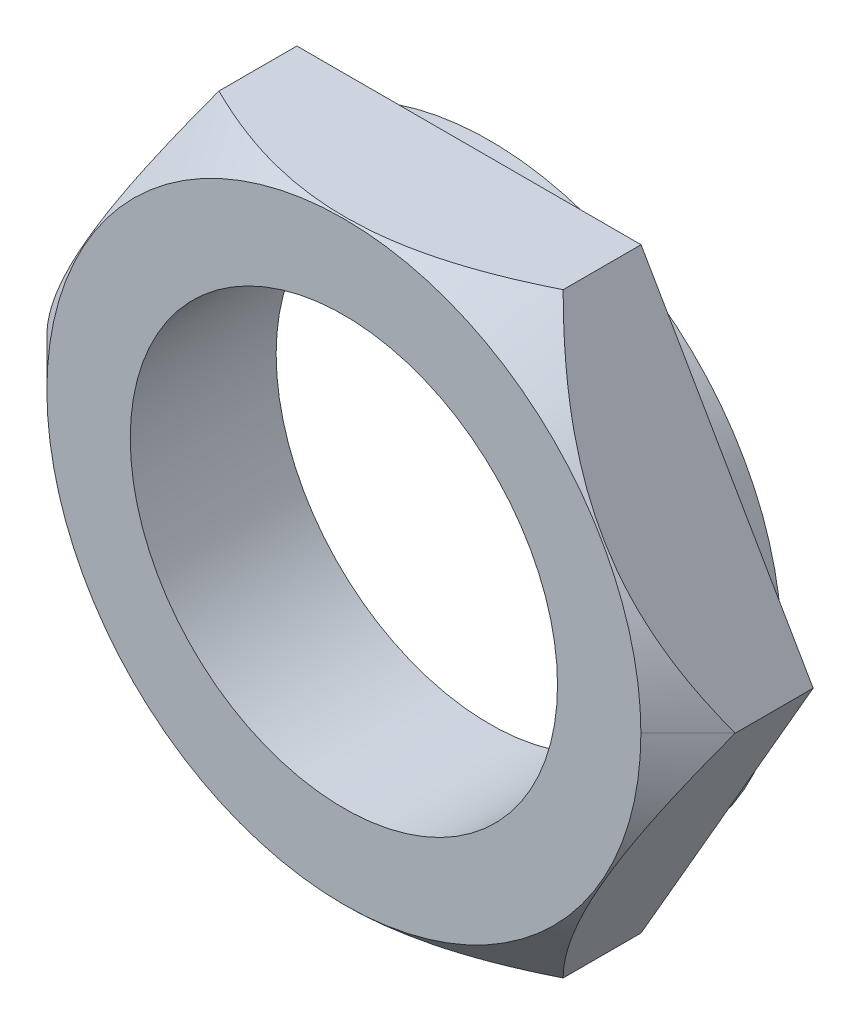
ISO-10303-21;
HEADER;
FILE_DESCRIPTION(('STEP AP214'),'2;1');
FILE_NAME('part.step','',(''),(''),'','','');
FILE_SCHEMA(('AUTOMOTIVE_DESIGN { 1 0 10303 214 1 1 1 1 }'));
ENDSEC;
DATA;
#1=APPLICATION_CONTEXT('core data for automotive mechanical design processes');
#2=APPLICATION_PROTOCOL_DEFINITION('international standard','automotive_design',2000,#1);
#3=PRODUCT_CONTEXT('',#1,'mechanical');
#4=PRODUCT('Part','Part','',(#3));
#5=PRODUCT_RELATED_PRODUCT_CATEGORY('part','',(#4));
#6=PRODUCT_DEFINITION_FORMATION('','',#4);
#7=PRODUCT_DEFINITION_CONTEXT('part definition',#1,'design');
#8=PRODUCT_DEFINITION('design','',#6,#7);
#9=PRODUCT_DEFINITION_SHAPE('','',#8);
#10=(LENGTH_UNIT() NAMED_UNIT(*) SI_UNIT(.MILLI.,.METRE.));
#11=(NAMED_UNIT(*) PLANE_ANGLE_UNIT() SI_UNIT($,.RADIAN.));
#12=(NAMED_UNIT(*) SI_UNIT($,.STERADIAN.) SOLID_ANGLE_UNIT());
#13=UNCERTAINTY_MEASURE_WITH_UNIT(LENGTH_MEASURE(1.E-05),#10,'distance_accuracy_value','');
#14=(GEOMETRIC_REPRESENTATION_CONTEXT(3) GLOBAL_UNCERTAINTY_ASSIGNED_CONTEXT((#13)) GLOBAL_UNIT_ASSIGNED_CONTEXT((#10,
#11,#12)) REPRESENTATION_CONTEXT('',''));
#15=CARTESIAN_POINT('',(0.,0.,0.));
#16=DIRECTION('',(0.,0.,1.));
#17=DIRECTION('',(1.,0.,0.));
#18=AXIS2_PLACEMENT_3D('',#15,#16,#17);
#19=CARTESIAN_POINT('',(16.51373013538,8.254175641598E-08,1.));
#20=DIRECTION('',(0.866025403784429,0.500000000000017,0.));
#21=DIRECTION('',(-0.500000000000017,0.866025403784429,0.));
#22=AXIS2_PLACEMENT_3D('',#19,#20,#21);
#23=PLANE('',#22);
#24=CARTESIAN_POINT('',(8.25762128596908,14.3000000825399,4.736822615648));
#25=CARTESIAN_POINT('',(8.39954677786595,14.0541779196853,4.87870588808626));
#26=CARTESIAN_POINT('',(8.54258366366023,13.8064307661332,5.01625877376431));
#27=CARTESIAN_POINT('',(8.8310530558437,13.3067871224429,5.28132864713024));
#28=CARTESIAN_POINT('',(8.97648681840168,13.0548884565566,5.40884015603742));
#29=CARTESIAN_POINT('',(9.27060826881066,12.5454551608524,5.65299176625953));
#30=CARTESIAN_POINT('',(9.41930981395623,12.2878965294963,5.76956548631781));
#31=CARTESIAN_POINT('',(9.71915475095405,11.7685498642238,5.98931038352818));
#32=CARTESIAN_POINT('',(9.87029776563053,11.506762483595,6.09248360903643));
#33=CARTESIAN_POINT('',(10.1725955137338,10.9831674248666,6.28216414644894));
#34=CARTESIAN_POINT('',(10.3237131248065,10.7214240445703,6.36890678543583));
#35=CARTESIAN_POINT('',(10.6280674131201,10.1942669537097,6.52594462282146));
#36=CARTESIAN_POINT('',(10.7813038605031,9.92885364127096,6.59624159069961));
#37=CARTESIAN_POINT('',(11.0892340350204,9.39550293382349,6.71862243722478));
#38=CARTESIAN_POINT('',(11.2439236660162,9.12757263353464,6.77074728489463));
#39=CARTESIAN_POINT('',(11.5546204441109,8.58943002812668,6.85562584228621));
#40=CARTESIAN_POINT('',(11.7106273909853,8.31921806980643,6.88838244396687));
#41=CARTESIAN_POINT('',(11.9789027892267,7.85455144963164,6.92717736496658));
#42=CARTESIAN_POINT('',(12.0909975756576,7.66039758426973,6.93816391537001));
#43=CARTESIAN_POINT('',(12.3153316107672,7.27183963759302,6.94958740130486));
#44=CARTESIAN_POINT('',(12.4275708676558,7.07743554205812,6.95002370818422));
#45=CARTESIAN_POINT('',(12.6519647508155,6.6887739355179,6.94033126676258));
#46=CARTESIAN_POINT('',(12.7641193477339,6.49451647535285,6.93019978917658));
#47=CARTESIAN_POINT('',(12.988076521033,6.1066112724793,6.89953240031666));
#48=CARTESIAN_POINT('',(13.0998790567068,5.91296360027721,6.87899532735644));
#49=CARTESIAN_POINT('',(13.4346282184246,5.33316104439101,6.8021398142141));
#50=CARTESIAN_POINT('',(13.6567372126289,4.94845698161118,6.73058555152673));
#51=CARTESIAN_POINT('',(14.0971012507686,4.18572409372701,6.55075878119341));
#52=CARTESIAN_POINT('',(14.3153565888107,3.80769475921496,6.44248908848216));
#53=CARTESIAN_POINT('',(14.7027845667695,3.13664981711677,6.21976366955292));
#54=CARTESIAN_POINT('',(14.8728135560273,2.84215096896269,6.11116784245941));
#55=CARTESIAN_POINT('',(15.2098179445051,2.25844224574537,5.87647895734004));
#56=CARTESIAN_POINT('',(15.3767932514827,1.96923253045083,5.75038537174461));
#57=CARTESIAN_POINT('',(15.7071662903548,1.39700964167351,5.48352752954469));
#58=CARTESIAN_POINT('',(15.8705734223982,1.11398018665525,5.34280944417274));
#59=CARTESIAN_POINT('',(16.1943623224455,0.553161360846444,5.04854911276128));
#60=CARTESIAN_POINT('',(16.3547458716826,0.27536890486957,4.89501472602539));
#61=CARTESIAN_POINT('',(16.5137300506138,2.29361149529073E-07,4.7360665962519));
#62=B_SPLINE_CURVE_WITH_KNOTS('',3,(#24,#25,#26,#27,#28,#29,#30,#31,#32,#33,#34,#35,#36,#37,#38,
#39,#40,#41,#42,#43,#44,#45,#46,#47,#48,#49,#50,#51,#52,#53,#54,#55,#56,#57,#58,#59,#60,#61),
.UNSPECIFIED.,.F.,.F.,(4,2,2,2,2,2,2,2,2,2,2,2,2,2,2,2,2,2,4),(0.,0.952048830505657,
1.90461357014065,2.86262889849327,3.82049761495449,4.76339172525062,5.70618433772154,
6.64683746726476,7.58735010821515,8.26049539378048,8.93368078961797,9.60704008849497,
10.2804745781383,11.6284148610398,12.976251822086,14.0466721253584,15.1171247095615,
16.1842948958693,17.2508154054556),.UNSPECIFIED.);
#63=CARTESIAN_POINT('',(8.25762128596804,14.3000000825399,4.73682261564847));
#64=VERTEX_POINT('',#63);
#65=CARTESIAN_POINT('',(16.5137301386817,5.40288536218199E-08,4.73606700464841));
#66=VERTEX_POINT('',#65);
#67=EDGE_CURVE('E102',#64,#66,#62,.T.);
#68=ORIENTED_EDGE('',*,*,#67,.T.);
#69=DIRECTION('',(0.,0.,1.));
#70=VECTOR('',#69,1.);
#71=CARTESIAN_POINT('',(16.5137301222198,5.97475666025471E-08,3.980869137822));
#72=LINE('',#71,#70);
#73=CARTESIAN_POINT('',(16.5137301287999,7.11446494793854E-08,1.));
#74=VERTEX_POINT('',#73);
#75=EDGE_CURVE('E89',#66,#74,#72,.F.);
#76=ORIENTED_EDGE('',*,*,#75,.T.);
#77=DIRECTION('',(-0.500000000000017,0.866025403784429,0.));
#78=VECTOR('',#77,1.);
#79=CARTESIAN_POINT('',(16.51373013538,8.254175641598E-08,1.));
#80=LINE('',#79,#78);
#81=CARTESIAN_POINT('',(8.257621285968,14.30000008254,1.));
#82=VERTEX_POINT('',#81);
#83=EDGE_CURVE('E187',#74,#82,#80,.T.);
#84=ORIENTED_EDGE('',*,*,#83,.T.);
#85=DIRECTION('',(0.,0.,-1.));
#86=VECTOR('',#85,1.);
#87=CARTESIAN_POINT('',(8.257621285967,14.30000008254,3.9814952156245));
#88=LINE('',#87,#86);
#89=EDGE_CURVE('E233',#82,#64,#88,.F.);
#90=ORIENTED_EDGE('',*,*,#89,.T.);
#91=EDGE_LOOP('',(#68,#76,#84,#90));
#92=FACE_BOUND('',#91,.T.);
#93=ADVANCED_FACE('F16',(#92),#23,.T.);
#94=CARTESIAN_POINT('',(8.257621285967,14.30000008254,1.));
#95=DIRECTION('',(0.,1.,0.));
#96=DIRECTION('',(-1.,0.,0.));
#97=AXIS2_PLACEMENT_3D('',#94,#95,#96);
#98=PLANE('',#97);
#99=CARTESIAN_POINT('',(-8.25459641285482,14.30000008254,4.73833507081814));
#100=CARTESIAN_POINT('',(-7.97077078889493,14.30000008254,4.88020566394706));
#101=CARTESIAN_POINT('',(-7.68472257055083,14.30000008254,5.01774624763975));
#102=CARTESIAN_POINT('',(-7.10783530809057,14.30000008254,5.28279238831056));
#103=CARTESIAN_POINT('',(-6.81699375182704,14.30000008254,5.4102924669215));
#104=CARTESIAN_POINT('',(-6.22880336426082,14.30000008254,5.65442215177435));
#105=CARTESIAN_POINT('',(-5.93142682087404,14.30000008254,5.77098538272577));
#106=CARTESIAN_POINT('',(-5.33179046707901,14.30000008254,5.99071045719156));
#107=CARTESIAN_POINT('',(-5.02953141097249,14.30000008254,6.09387434892852));
#108=CARTESIAN_POINT('',(-4.4249912208498,14.30000008254,6.28353723158577));
#109=CARTESIAN_POINT('',(-4.12278434613097,14.30000008254,6.37027159623239));
#110=CARTESIAN_POINT('',(-3.51413287586359,14.30000008254,6.52729445596543));
#111=CARTESIAN_POINT('',(-3.2076887399857,14.30000008254,6.59758472036013));
#112=CARTESIAN_POINT('',(-2.59188619042485,14.30000008254,6.71995390642652));
#113=CARTESIAN_POINT('',(-2.28253596817083,14.30000008254,6.77207379294028));
#114=CARTESIAN_POINT('',(-1.66120074737954,14.30000008254,6.85694428924556));
#115=CARTESIAN_POINT('',(-1.34921614924834,14.30000008254,6.8896977906905));
#116=CARTESIAN_POINT('',(-0.812715466712609,14.30000008254,6.92848908661515));
#117=CARTESIAN_POINT('',(-0.588546677938357,14.30000008254,6.93947462369311));
#118=CARTESIAN_POINT('',(-0.13992020268907,14.30000008254,6.95089707294918));
#119=CARTESIAN_POINT('',(0.0845375002042332,14.30000008254,6.95133335654125));
#120=CARTESIAN_POINT('',(0.53328365768861,14.30000008254,6.9416418597743));
#121=CARTESIAN_POINT('',(0.75757205358454,14.30000008254,6.93151135058705));
#122=CARTESIAN_POINT('',(1.20544487197078,14.30000008254,6.90084687458269));
#123=CARTESIAN_POINT('',(1.42902921305326,14.30000008254,6.88031174616273));
#124=CARTESIAN_POINT('',(2.09846647412748,14.30000008254,6.80346337932087));
#125=CARTESIAN_POINT('',(2.54264428375279,14.30000008254,6.73191565404634));
#126=CARTESIAN_POINT('',(3.42329269720923,14.30000008254,6.55210523716669));
#127=CARTESIAN_POINT('',(3.85976388875012,14.30000008254,6.44384535807881));
#128=CARTESIAN_POINT('',(4.63468530354576,14.30000008254,6.22110112059682));
#129=CARTESIAN_POINT('',(4.97484574614305,14.30000008254,6.11246823441584));
#130=CARTESIAN_POINT('',(5.6490552018575,14.30000008254,5.87769391464925));
#131=CARTESIAN_POINT('',(5.98310402768678,14.30000008254,5.75155194551906));
#132=CARTESIAN_POINT('',(6.64404155026839,14.30000008254,5.48458893948026));
#133=CARTESIAN_POINT('',(6.97094906876813,14.30000008254,5.3438141214909));
#134=CARTESIAN_POINT('',(7.61870923738103,14.30000008254,5.04943384716587));
#135=CARTESIAN_POINT('',(7.93956545827722,14.30000008254,4.89583626750104));
#136=CARTESIAN_POINT('',(8.25762128596738,14.30000008254,4.73682261564874));
#137=B_SPLINE_CURVE_WITH_KNOTS('',3,(#99,#100,#101,#102,#103,#104,#105,#106,#107,#108,#109,#110,
#111,#112,#113,#114,#115,#116,#117,#118,#119,#120,#121,#122,#123,#124,#125,#126,#127,#128,#129,
#130,#131,#132,#133,#134,#135,#136),.UNSPECIFIED.,.F.,.F.,(4,2,2,2,2,2,2,2,2,2,2,2,2,2,2,2,2,2,
4),(0.,0.951963768693295,1.90444340623945,2.8623731269658,3.82015624581889,4.76296180654899,
5.7056658791078,6.64623068293629,7.5866550127067,8.25973789375865,8.93286088091548,
9.60615774220191,10.2795297889347,11.6273481010083,12.9750631800717,14.0458095257932,
15.1165886293021,16.1840828449746,17.2509260862873),.UNSPECIFIED.);
#138=CARTESIAN_POINT('',(-8.25459641285541,14.30000008254,4.73833507081784));
#139=VERTEX_POINT('',#138);
#140=EDGE_CURVE('E190',#139,#64,#137,.T.);
#141=ORIENTED_EDGE('',*,*,#140,.T.);
#142=ORIENTED_EDGE('',*,*,#89,.F.);
#143=DIRECTION('',(-1.,0.,0.));
#144=VECTOR('',#143,1.);
#145=CARTESIAN_POINT('',(0.00151243655499783,14.30000008254,1.));
#146=LINE('',#145,#144);
#147=CARTESIAN_POINT('',(-8.254596412856,14.30000008254,1.));
#148=VERTEX_POINT('',#147);
#149=EDGE_CURVE('E186',#82,#148,#146,.T.);
#150=ORIENTED_EDGE('',*,*,#149,.T.);
#151=DIRECTION('',(0.,0.,-1.));
#152=VECTOR('',#151,1.);
#153=CARTESIAN_POINT('',(-8.254596412856,14.30000008254,3.982164556286));
#154=LINE('',#153,#152);
#155=EDGE_CURVE('E217',#148,#139,#154,.F.);
#156=ORIENTED_EDGE('',*,*,#155,.T.);
#157=EDGE_LOOP('',(#141,#142,#150,#156));
#158=FACE_BOUND('',#157,.T.);
#159=ADVANCED_FACE('F203',(#158),#98,.T.);
#160=CARTESIAN_POINT('',(-8.254596412856,14.30000008254,1.));
#161=DIRECTION('',(-0.866025403784429,0.500000000000017,0.));
#162=DIRECTION('',(-0.500000000000017,-0.866025403784429,0.));
#163=AXIS2_PLACEMENT_3D('',#160,#161,#162);
#164=PLANE('',#163);
#165=CARTESIAN_POINT('',(-16.5107052896503,2.55266203965353E-07,4.739091550136));
#166=CARTESIAN_POINT('',(-16.3687829457166,0.245816824632592,4.88099105018256));
#167=CARTESIAN_POINT('',(-16.2257491615185,0.493558548168336,5.01856045742969));
#168=CARTESIAN_POINT('',(-15.9372857059679,0.993191866890356,5.2836636859947));
#169=CARTESIAN_POINT('',(-15.7918547779081,1.24508563879741,5.41119202690896));
#170=CARTESIAN_POINT('',(-15.4977381644451,1.75451056809686,5.65537774038718));
#171=CARTESIAN_POINT('',(-15.3490386119842,2.01206574382487,5.77196869558431));
#172=CARTESIAN_POINT('',(-15.0491971528013,2.53140638227552,5.99174748491539));
#173=CARTESIAN_POINT('',(-14.8980556234475,2.79319119137633,6.09493736811072));
#174=CARTESIAN_POINT('',(-14.5957612459667,3.31678041282555,6.28464914291703));
#175=CARTESIAN_POINT('',(-14.4446455455851,3.5785204834137,6.37140648082448));
#176=CARTESIAN_POINT('',(-14.1402944739411,4.10567200262373,6.52847209634263));
#177=CARTESIAN_POINT('',(-13.9870593327348,4.37108305277686,6.59878214462253));
#178=CARTESIAN_POINT('',(-13.6791313548894,4.90442995553465,6.72118670013931));
#179=CARTESIAN_POINT('',(-13.5244426179481,5.17235870725454,6.77332220369373));
#180=CARTESIAN_POINT('',(-13.2137471367794,5.7104990663055,6.85821906942017));
#181=CARTESIAN_POINT('',(-13.0577405930079,5.98071032643678,6.89098332624347));
#182=CARTESIAN_POINT('',(-12.7894849532558,6.44534272390731,6.92978556140288));
#183=CARTESIAN_POINT('',(-12.6774096590434,6.63946282775554,6.94077442571471));
#184=CARTESIAN_POINT('',(-12.4531145348938,7.02795337867182,6.95220429338837));
#185=CARTESIAN_POINT('',(-12.3408946967459,7.22232383996141,6.952644668493));
#186=CARTESIAN_POINT('',(-12.1165395305584,7.61091838673884,6.94296205390519));
#187=CARTESIAN_POINT('',(-12.0044042318534,7.80514242141776,6.93283633430264));
#188=CARTESIAN_POINT('',(-11.780485509548,8.19298102521665,6.90218206609307));
#189=CARTESIAN_POINT('',(-11.6687021266389,8.38659552385715,6.88165235595318));
#190=CARTESIAN_POINT('',(-11.3340100405907,8.96629922178375,6.8048211708736));
#191=CARTESIAN_POINT('',(-11.1119387148656,9.35093804084376,6.7332861124228));
#192=CARTESIAN_POINT('',(-10.6716492050351,10.1135418419097,6.55350287665618));
#193=CARTESIAN_POINT('',(-10.4534307270214,10.4915073329798,6.44525751256833));
#194=CARTESIAN_POINT('',(-10.0659935555992,11.1625681986237,6.22253671557048));
#195=CARTESIAN_POINT('',(-9.89591994587468,11.4571443316933,6.11391169174401));
#196=CARTESIAN_POINT('',(-9.55882844539231,12.0410039373284,5.87915257924174));
#197=CARTESIAN_POINT('',(-9.39181064846878,12.3302872473681,5.75301795391973));
#198=CARTESIAN_POINT('',(-9.06135475832435,12.9026536387587,5.48606896551322));
#199=CARTESIAN_POINT('',(-8.89790726101851,13.1857530084624,5.34530078859706));
#200=CARTESIAN_POINT('',(-8.57403976526933,13.74670796602,5.05093355411387));
#201=CARTESIAN_POINT('',(-8.4136179809411,14.0245666471173,4.89734237543926));
#202=CARTESIAN_POINT('',(-8.25459641285556,14.3000000825408,4.73833507081711));
#203=B_SPLINE_CURVE_WITH_KNOTS('',3,(#165,#166,#167,#168,#169,#170,#171,#172,#173,#174,#175,
#176,#177,#178,#179,#180,#181,#182,#183,#184,#185,#186,#187,#188,#189,#190,#191,#192,#193,#194,
#195,#196,#197,#198,#199,#200,#201,#202),.UNSPECIFIED.,.F.,.F.,(4,2,2,2,2,2,2,2,2,2,2,2,2,2,2,2,
2,2,4),(0.,0.952053397169276,1.90462287300452,2.86264590580076,3.82052228129645,
4.76341746000609,5.70621108249269,6.64686407141496,7.58737646272554,8.26040532171031,
8.93347426550438,9.60671714988981,10.2800352137054,11.6277434107915,12.9753483520225,
14.0460496755976,15.1167838220054,16.184235625366,17.2510363097751),.UNSPECIFIED.);
#204=CARTESIAN_POINT('',(-16.51070526227,5.96592233408909E-08,4.73909191821808));
#205=VERTEX_POINT('',#204);
#206=EDGE_CURVE('E197',#205,#139,#203,.T.);
#207=ORIENTED_EDGE('',*,*,#206,.T.);
#208=ORIENTED_EDGE('',*,*,#155,.F.);
#209=DIRECTION('',(-0.500000000000017,-0.866025403784429,0.));
#210=VECTOR('',#209,1.);
#211=CARTESIAN_POINT('',(-8.254596412856,14.30000008254,1.));
#212=LINE('',#211,#210);
#213=CARTESIAN_POINT('',(-16.5107052622693,8.2540460730801E-08,1.));
#214=VERTEX_POINT('',#213);
#215=EDGE_CURVE('E183',#148,#214,#212,.T.);
#216=ORIENTED_EDGE('',*,*,#215,.T.);
#217=DIRECTION('',(0.,0.,-1.));
#218=VECTOR('',#217,1.);
#219=CARTESIAN_POINT('',(-16.51070526227,8.254175988542E-08,3.982170199751));
#220=LINE('',#219,#218);
#221=EDGE_CURVE('E99',#214,#205,#220,.F.);
#222=ORIENTED_EDGE('',*,*,#221,.T.);
#223=EDGE_LOOP('',(#207,#208,#216,#222));
#224=FACE_BOUND('',#223,.T.);
#225=ADVANCED_FACE('F206',(#224),#164,.T.);
#226=CARTESIAN_POINT('',(-16.51070526227,8.254175988542E-08,1.));
#227=DIRECTION('',(-0.866025403784429,-0.500000000000017,0.));
#228=DIRECTION('',(0.500000000000017,-0.866025403784429,0.));
#229=AXIS2_PLACEMENT_3D('',#226,#227,#228);
#230=PLANE('',#229);
#231=CARTESIAN_POINT('',(-8.25459641285823,-14.2999999174578,4.73833620658472));
#232=CARTESIAN_POINT('',(-8.39654084915375,-14.0541449419423,4.88027737179255));
#233=CARTESIAN_POINT('',(-8.53959704645457,-13.8063643398796,5.01788794622269));
#234=CARTESIAN_POINT('',(-8.82810608156758,-13.3066520326213,5.28307204455245));
#235=CARTESIAN_POINT('',(-8.97356017685068,-13.054718149422,5.41064008559842));
#236=CARTESIAN_POINT('',(-9.26772451379603,-12.5452105720579,5.65490377521168));
#237=CARTESIAN_POINT('',(-9.41644863467957,-12.2876128383766,5.77153295840586));
#238=CARTESIAN_POINT('',(-9.71634017038486,-11.7681854617752,5.99138530997413));
#239=CARTESIAN_POINT('',(-9.86750720759699,-11.5063564728941,6.09461052837224));
#240=CARTESIAN_POINT('',(-10.16985355849,-10.9826772316643,6.2843888670609));
#241=CARTESIAN_POINT('',(-10.3209957136292,-10.7208913397978,6.3711774596761));
#242=CARTESIAN_POINT('',(-10.625400711794,-10.1936464168985,6.5283008190417));
#243=CARTESIAN_POINT('',(-10.7786633245199,-9.92818778475653,6.59863735799659));
#244=CARTESIAN_POINT('',(-11.0866469429497,-9.39474450973727,6.72108894563322));
#245=CARTESIAN_POINT('',(-11.2413638445455,-9.12676697538362,6.77324502631128));
#246=CARTESIAN_POINT('',(-11.5521164023457,-8.58852775669186,6.85817631539363));
#247=CARTESIAN_POINT('',(-11.7081518578197,-8.3182664200286,6.89095442175216));
#248=CARTESIAN_POINT('',(-11.9764378830993,-7.85358139328377,6.92977120434102));
#249=CARTESIAN_POINT('',(-12.0885144800437,-7.65945903303659,6.94076440030099));
#250=CARTESIAN_POINT('',(-12.3128123097121,-7.2709637960235,6.95220270381329));
#251=CARTESIAN_POINT('',(-12.4250335506494,-7.07659090503167,6.95264718337111));
#252=CARTESIAN_POINT('',(-12.6493916297048,-6.68799131301921,6.94297248433477));
#253=CARTESIAN_POINT('',(-12.7615284384963,-6.49376466279372,6.93285057429424));
#254=CARTESIAN_POINT('',(-12.9854502584555,-6.10592069370113,6.90220357669099));
#255=CARTESIAN_POINT('',(-13.0972352289414,-5.91230344529697,6.88167732758166));
#256=CARTESIAN_POINT('',(-13.4319313317603,-5.33259279011936,6.80485613837701));
#257=CARTESIAN_POINT('',(-13.6540051873435,-4.94794958921662,6.73332718109381));
#258=CARTESIAN_POINT('',(-14.0942998697281,-4.18533682902402,6.55355471453854));
#259=CARTESIAN_POINT('',(-14.3125209907427,-3.8073667601422,6.44531402161825));
#260=CARTESIAN_POINT('',(-14.699901882465,-3.13640337379782,6.22263545258157));
#261=CARTESIAN_POINT('',(-14.8699176168195,-2.84192748380962,6.11405535596154));
#262=CARTESIAN_POINT('',(-15.2068954884919,-2.25826468904664,5.87939690734442));
#263=CARTESIAN_POINT('',(-15.3738575331887,-1.96907794469629,5.75331802558664));
#264=CARTESIAN_POINT('',(-15.7042047698584,-1.39689974664445,5.48648826016689));
#265=CARTESIAN_POINT('',(-15.8675993484211,-1.11389203489246,5.34578348231699));
#266=CARTESIAN_POINT('',(-16.1913630139602,-0.553116916533997,5.05154928768999));
#267=CARTESIAN_POINT('',(-16.3517338831512,-0.275346423041245,4.89802773463701));
#268=CARTESIAN_POINT('',(-16.5107053434857,2.23211545998502E-07,4.73909233337591));
#269=B_SPLINE_CURVE_WITH_KNOTS('',3,(#231,#232,#233,#234,#235,#236,#237,#238,#239,#240,#241,
#242,#243,#244,#245,#246,#247,#248,#249,#250,#251,#252,#253,#254,#255,#256,#257,#258,#259,#260,
#261,#262,#263,#264,#265,#266,#267,#268),.UNSPECIFIED.,.F.,.F.,(4,2,2,2,2,2,2,2,2,2,2,2,2,2,2,2,
2,2,4),(0.,0.952228207118937,1.90497274134988,2.86317481284108,3.82123016231733,
4.76430362207572,5.70727544774476,6.64810506020918,7.5887939370493,8.26183124247035,
8.93490861557985,9.6081600244941,10.2814866121554,11.6292067945805,12.9768236096261,
14.0471536828322,15.1175161664327,16.1846013355089,17.2510365401602),.UNSPECIFIED.);
#270=CARTESIAN_POINT('',(-8.25459641285712,-14.2999999174589,4.73833620658434));
#271=VERTEX_POINT('',#270);
#272=EDGE_CURVE('E20',#271,#205,#269,.T.);
#273=ORIENTED_EDGE('',*,*,#272,.T.);
#274=ORIENTED_EDGE('',*,*,#221,.F.);
#275=DIRECTION('',(0.500000000000017,-0.866025403784429,0.));
#276=VECTOR('',#275,1.);
#277=CARTESIAN_POINT('',(-16.51070526227,8.254175988542E-08,1.));
#278=LINE('',#277,#276);
#279=CARTESIAN_POINT('',(-8.25459641285649,-14.29999991746,1.));
#280=VERTEX_POINT('',#279);
#281=EDGE_CURVE('E94',#214,#280,#278,.T.);
#282=ORIENTED_EDGE('',*,*,#281,.T.);
#283=DIRECTION('',(0.,0.,-1.));
#284=VECTOR('',#283,1.);
#285=CARTESIAN_POINT('',(-8.254596412856,-14.29999991746,3.981525174965));
#286=LINE('',#285,#284);
#287=EDGE_CURVE('E91',#280,#271,#286,.F.);
#288=ORIENTED_EDGE('',*,*,#287,.T.);
#289=EDGE_LOOP('',(#273,#274,#282,#288));
#290=FACE_BOUND('',#289,.T.);
#291=ADVANCED_FACE('F92',(#290),#230,.T.);
#292=CARTESIAN_POINT('',(-8.254596412856,-14.29999991746,1.));
#293=DIRECTION('',(0.,-1.,0.));
#294=DIRECTION('',(1.,0.,0.));
#295=AXIS2_PLACEMENT_3D('',#292,#293,#294);
#296=PLANE('',#295);
#297=CARTESIAN_POINT('',(8.25762128596447,-14.29999991746,4.73682375149444));
#298=CARTESIAN_POINT('',(7.97370705407342,-14.29999991746,4.87877759565653));
#299=CARTESIAN_POINT('',(7.68756910677157,-14.29999991746,5.01640047173093));
#300=CARTESIAN_POINT('',(7.11049951575532,-14.29999991746,5.28160830211336));
#301=CARTESIAN_POINT('',(6.81956535690893,-14.29999991746,5.40918777315434));
#302=CARTESIAN_POINT('',(6.23118417094272,-14.29999991746,5.65347338758938));
#303=CARTESIAN_POINT('',(5.93370938287545,-14.29999991746,5.77011305964469));
#304=CARTESIAN_POINT('',(5.33387279250282,-14.29999991746,5.98998523354157));
#305=CARTESIAN_POINT('',(5.0315117454665,-14.29999991746,6.09321978554065));
#306=CARTESIAN_POINT('',(4.42676373770385,-14.29999991746,6.28301577926575));
#307=CARTESIAN_POINT('',(4.12445107944207,-14.29999991746,6.36981264660251));
#308=CARTESIAN_POINT('',(3.51558397560736,-14.29999991746,6.52695098432031));
#309=CARTESIAN_POINT('',(3.20902999067925,-14.29999991746,6.597294227077));
#310=CARTESIAN_POINT('',(2.59300495314824,-14.29999991746,6.71975747572233));
#311=CARTESIAN_POINT('',(2.28354210960965,-14.29999991746,6.77191851778885));
#312=CARTESIAN_POINT('',(1.66197865736968,-14.29999991746,6.85685786831964));
#313=CARTESIAN_POINT('',(1.34987845017141,-14.29999991746,6.88963907504373));
#314=CARTESIAN_POINT('',(0.813256285033128,-14.29999991746,6.92845948278708));
#315=CARTESIAN_POINT('',(0.589082307061976,-14.29999991746,6.93945369208042));
#316=CARTESIAN_POINT('',(0.140445052765053,-14.29999991746,6.95089303228734));
#317=CARTESIAN_POINT('',(-0.0840182399890873,-14.29999991746,6.95133753514035));
#318=CARTESIAN_POINT('',(-0.532776006930577,-14.29999991746,6.9416618914648));
#319=CARTESIAN_POINT('',(-0.757070422454599,-14.29999991746,6.93153901303288));
#320=CARTESIAN_POINT('',(-1.2049555905859,-14.29999991746,6.90088910258763));
#321=CARTESIAN_POINT('',(-1.42854626182362,-14.29999991746,6.88036090894424));
#322=CARTESIAN_POINT('',(-2.09799952985268,-14.29999991746,6.8035325734204));
#323=CARTESIAN_POINT('',(-2.54218741982831,-14.29999991746,6.73199707869912));
#324=CARTESIAN_POINT('',(-3.42285644744809,-14.29999991746,6.55220825864402));
#325=CARTESIAN_POINT('',(-3.85933817402239,-14.29999991746,6.44395775208191));
#326=CARTESIAN_POINT('',(-4.63403450288153,-14.29999991746,6.22129799687546));
#327=CARTESIAN_POINT('',(-4.97396351097703,-14.29999991746,6.11275495237177));
#328=CARTESIAN_POINT('',(-5.64771858093508,-14.29999991746,5.87818192173465));
#329=CARTESIAN_POINT('',(-5.98154446035372,-14.29999991746,5.75215141380381));
#330=CARTESIAN_POINT('',(-6.64204748961912,-14.29999991746,5.48542679241322));
#331=CARTESIAN_POINT('',(-6.96874339124851,-14.29999991746,5.34477873718956));
#332=CARTESIAN_POINT('',(-7.6160883505496,-14.29999991746,5.05066446549861));
#333=CARTESIAN_POINT('',(-7.93674096434306,-14.29999991746,4.89720609540477));
#334=CARTESIAN_POINT('',(-8.25459641285488,-14.29999991746,4.73833620658451));
#335=B_SPLINE_CURVE_WITH_KNOTS('',3,(#297,#298,#299,#300,#301,#302,#303,#304,#305,#306,#307,
#308,#309,#310,#311,#312,#313,#314,#315,#316,#317,#318,#319,#320,#321,#322,#323,#324,#325,#326,
#327,#328,#329,#330,#331,#332,#333,#334),.UNSPECIFIED.,.F.,.F.,(4,2,2,2,2,2,2,2,2,2,2,2,2,2,2,2,
2,2,4),(0.,0.952313267022119,1.90514290142182,2.86343057861041,3.82157152377095,
4.76473353505283,5.70779390259042,6.6487118426964,7.58948903263994,8.26258874255921,
8.93572852433409,9.60904237083547,10.2824314014034,11.6302735547443,12.9780122517751,
14.0480162988281,15.1180522799268,16.1848134307118,17.2509259136098),.UNSPECIFIED.);
#336=CARTESIAN_POINT('',(8.25762128596573,-14.29999991746,4.73682375149381));
#337=VERTEX_POINT('',#336);
#338=EDGE_CURVE('E84',#337,#271,#335,.T.);
#339=ORIENTED_EDGE('',*,*,#338,.T.);
#340=ORIENTED_EDGE('',*,*,#287,.F.);
#341=DIRECTION('',(1.,0.,0.));
#342=VECTOR('',#341,1.);
#343=CARTESIAN_POINT('',(0.00151243655499783,-14.29999991746,1.));
#344=LINE('',#343,#342);
#345=CARTESIAN_POINT('',(8.257621285967,-14.29999991746,1.));
#346=VERTEX_POINT('',#345);
#347=EDGE_CURVE('E181',#280,#346,#344,.T.);
#348=ORIENTED_EDGE('',*,*,#347,.T.);
#349=DIRECTION('',(0.,0.,-1.));
#350=VECTOR('',#349,1.);
#351=CARTESIAN_POINT('',(8.257621285967,-14.29999991746,3.980869137822));
#352=LINE('',#351,#350);
#353=EDGE_CURVE('E98',#346,#337,#352,.F.);
#354=ORIENTED_EDGE('',*,*,#353,.T.);
#355=EDGE_LOOP('',(#339,#340,#348,#354));
#356=FACE_BOUND('',#355,.T.);
#357=ADVANCED_FACE('F101',(#356),#296,.T.);
#358=CARTESIAN_POINT('',(8.257621285967,-14.29999991746,1.));
#359=DIRECTION('',(0.866025403784429,-0.500000000000017,0.));
#360=DIRECTION('',(0.500000000000017,0.866025403784429,0.));
#361=AXIS2_PLACEMENT_3D('',#358,#359,#360);
#362=PLANE('',#361);
#363=CARTESIAN_POINT('',(16.5137302272301,2.41630705963455E-07,4.73606741256447));
#364=CARTESIAN_POINT('',(16.3717825805422,-0.24586029444747,4.87799230968685));
#365=CARTESIAN_POINT('',(16.2287232596983,-0.493646306645364,5.01558634062749));
#366=CARTESIAN_POINT('',(15.9402082797754,-0.993368910616557,5.28073705679742));
#367=CARTESIAN_POINT('',(15.7947513637816,-1.24530767943017,5.40828826079628));
#368=CARTESIAN_POINT('',(15.5005822083683,-1.7548236026256,5.65251783318665));
#369=CARTESIAN_POINT('',(15.3518560994425,-2.01242477969701,5.76912977230919));
#370=CARTESIAN_POINT('',(15.0519610981593,-2.53185815885552,5.98894821615747));
#371=CARTESIAN_POINT('',(14.9007925832193,-2.79368970723622,6.09215677020673));
#372=CARTESIAN_POINT('',(14.5984428757033,-3.31737476230754,6.28190386010068));
#373=CARTESIAN_POINT('',(14.4472988162684,-3.57916395251097,6.36867774895813));
#374=CARTESIAN_POINT('',(14.1428906147432,-4.10641442379324,6.52577332252538));
#375=CARTESIAN_POINT('',(13.9896267027543,-4.37187530632483,6.59609677824779));
#376=CARTESIAN_POINT('',(13.6816409016441,-4.90532236185752,6.71852465377519));
#377=CARTESIAN_POINT('',(13.5269231130682,-5.17330143250559,6.77067007825931));
#378=CARTESIAN_POINT('',(13.2161692727161,-5.7115428726426,6.8555830613821));
#379=CARTESIAN_POINT('',(13.0601334214383,-5.98180489485789,6.88835351528149));
#380=CARTESIAN_POINT('',(12.7918276470752,-6.44652412801903,6.92716299308785));
#381=CARTESIAN_POINT('',(12.6797315599667,-6.64068024622055,6.93815388040592));
#382=CARTESIAN_POINT('',(12.4553948233237,-7.02924287209034,6.94958581310514));
#383=CARTESIAN_POINT('',(12.3431541655767,-7.2236493939831,6.95002623009693));
#384=CARTESIAN_POINT('',(12.1187573732617,-7.6123160393282,6.94034171585343));
#385=CARTESIAN_POINT('',(12.0066012680384,-7.80657611195404,6.93021405379571));
#386=CARTESIAN_POINT('',(11.7826410005094,-8.19448667419096,6.89955394768989));
#387=CARTESIAN_POINT('',(11.670836878901,-8.3881370933122,6.87902034194184));
#388=CARTESIAN_POINT('',(11.3360837052417,-8.96794659808506,6.80217484346271));
#389=CARTESIAN_POINT('',(11.1139721841567,-9.35265503755063,6.73062669475262));
#390=CARTESIAN_POINT('',(10.6736029789795,-10.1153968750062,6.55081071914814));
#391=CARTESIAN_POINT('',(10.4553450004755,-10.4934307829325,6.44254571031677));
#392=CARTESIAN_POINT('',(10.0679732834344,-11.1643782782627,6.21986252810515));
#393=CARTESIAN_POINT('',(9.89800214911596,-11.4587769187224,6.1113116185937));
#394=CARTESIAN_POINT('',(9.56111135016126,-12.0422888991144,5.87672336942349));
#395=CARTESIAN_POINT('',(9.39419177655807,-12.3314020813729,5.75068550906064));
#396=CARTESIAN_POINT('',(9.06392735515506,-12.9034368391752,5.48394684756284));
#397=CARTESIAN_POINT('',(8.90057312469084,-13.1863746659705,5.34329213734717));
#398=CARTESIAN_POINT('',(8.57688802206036,-13.7470137093796,5.04916479453464));
#399=CARTESIAN_POINT('',(8.41655537232305,-14.0247180048368,4.8957000061047));
#400=CARTESIAN_POINT('',(8.2576212859679,-14.2999999174584,4.73682375149407));
#401=B_SPLINE_CURVE_WITH_KNOTS('',3,(#363,#364,#365,#366,#367,#368,#369,#370,#371,#372,#373,
#374,#375,#376,#377,#378,#379,#380,#381,#382,#383,#384,#385,#386,#387,#388,#389,#390,#391,#392,
#393,#394,#395,#396,#397,#398,#399,#400),.UNSPECIFIED.,.F.,.F.,(4,2,2,2,2,2,2,2,2,2,2,2,2,2,2,2,
2,2,4),(0.,0.952223592188672,1.9049633427437,2.8631576608287,3.82120530194984,4.76427764948045,
5.70724842141974,6.64807813146894,7.58876721491863,8.26192093515576,8.93511474854262,
9.60848256025972,10.2819255620554,11.6298778062369,12.9777266168724,14.0477757946197,
15.1178568417665,16.1846605184895,17.2508156709655),.UNSPECIFIED.);
#402=EDGE_CURVE('E88',#66,#337,#401,.T.);
#403=ORIENTED_EDGE('',*,*,#402,.T.);
#404=ORIENTED_EDGE('',*,*,#353,.F.);
#405=DIRECTION('',(0.500000000000017,0.866025403784429,0.));
#406=VECTOR('',#405,1.);
#407=CARTESIAN_POINT('',(8.257621285967,-14.29999991746,1.));
#408=LINE('',#407,#406);
#409=EDGE_CURVE('E176',#346,#74,#408,.T.);
#410=ORIENTED_EDGE('',*,*,#409,.T.);
#411=ORIENTED_EDGE('',*,*,#75,.F.);
#412=EDGE_LOOP('',(#403,#404,#410,#411));
#413=FACE_BOUND('',#412,.T.);
#414=ADVANCED_FACE('F127',(#413),#362,.T.);
#415=CARTESIAN_POINT('',(0.,0.,6.9999156637739));
#416=DIRECTION('',(0.,0.,-1.));
#417=DIRECTION('',(-1.,0.,0.));
#418=AXIS2_PLACEMENT_3D('',#415,#416,#417);
#419=CONICAL_SURFACE('',#418,14.2499097170119,0.785392036405235);
#420=ORIENTED_EDGE('',*,*,#402,.F.);
#421=DIRECTION('',(-0.707102427477713,-2.06859488426763E-09,0.707111134868576));
#422=VECTOR('',#421,1.);
#423=CARTESIAN_POINT('',(15.38180677734,4.49987520533603E-08,5.8680038082395));
#424=LINE('',#423,#422);
#425=CARTESIAN_POINT('',(14.2499094723126,1.52939844650811E-08,6.99995768495544));
#426=VERTEX_POINT('',#425);
#427=EDGE_CURVE('E105',#66,#426,#424,.T.);
#428=ORIENTED_EDGE('',*,*,#427,.T.);
#429=CARTESIAN_POINT('',(0.,0.,7.));
#430=DIRECTION('',(0.,0.,1.));
#431=DIRECTION('',(1.,0.,0.));
#432=AXIS2_PLACEMENT_3D('',#429,#430,#431);
#433=CIRCLE('',#432,14.2498253818192);
#434=CARTESIAN_POINT('',(-14.2499094723126,2.3270777905375E-09,6.99995768495486));
#435=VERTEX_POINT('',#434);
#436=EDGE_CURVE('E172',#426,#435,#433,.F.);
#437=ORIENTED_EDGE('',*,*,#436,.T.);
#438=DIRECTION('',(-0.707102427477713,-3.84944777688999E-10,-0.707111134868576));
#439=VECTOR('',#438,1.);
#440=CARTESIAN_POINT('',(-15.38180677734,-8.37381680540888E-09,5.8680038082395));
#441=LINE('',#440,#439);
#442=EDGE_CURVE('E41',#435,#205,#441,.T.);
#443=ORIENTED_EDGE('',*,*,#442,.T.);
#444=ORIENTED_EDGE('',*,*,#272,.F.);
#445=ORIENTED_EDGE('',*,*,#338,.F.);
#446=EDGE_LOOP('',(#420,#428,#437,#443,#444,#445));
#447=FACE_BOUND('',#446,.T.);
#448=ADVANCED_FACE('F82',(#447),#419,.T.);
#449=CARTESIAN_POINT('',(0.,0.,6.99991522541783));
#450=DIRECTION('',(0.,0.,-1.));
#451=DIRECTION('',(-1.,0.,0.));
#452=AXIS2_PLACEMENT_3D('',#449,#450,#451);
#453=CONICAL_SURFACE('',#452,14.2499092985578,0.785392006342322);
#454=ORIENTED_EDGE('',*,*,#206,.F.);
#455=ORIENTED_EDGE('',*,*,#442,.F.);
#456=CARTESIAN_POINT('',(0.,0.,7.));
#457=DIRECTION('',(0.,0.,1.));
#458=DIRECTION('',(1.,0.,0.));
#459=AXIS2_PLACEMENT_3D('',#456,#457,#458);
#460=CIRCLE('',#459,14.2498245250196);
#461=EDGE_CURVE('E170',#435,#426,#460,.F.);
#462=ORIENTED_EDGE('',*,*,#461,.T.);
#463=ORIENTED_EDGE('',*,*,#427,.F.);
#464=ORIENTED_EDGE('',*,*,#67,.F.);
#465=ORIENTED_EDGE('',*,*,#140,.F.);
#466=EDGE_LOOP('',(#454,#455,#462,#463,#464,#465));
#467=FACE_BOUND('',#466,.T.);
#468=ADVANCED_FACE('F137',(#467),#453,.T.);
#469=CARTESIAN_POINT('',(-16.51070526227,-14.29999991746,1.));
#470=DIRECTION('',(0.,0.,1.));
#471=DIRECTION('',(1.,0.,0.));
#472=AXIS2_PLACEMENT_3D('',#469,#470,#471);
#473=PLANE('',#472);
#474=CARTESIAN_POINT('',(0.,0.,1.));
#475=DIRECTION('',(0.,0.,1.));
#476=DIRECTION('',(1.,0.,0.));
#477=AXIS2_PLACEMENT_3D('',#474,#475,#476);
#478=CIRCLE('',#477,14.);
#479=CARTESIAN_POINT('',(14.,0.,1.));
#480=VERTEX_POINT('',#479);
#481=EDGE_CURVE('E164',#480,#480,#478,.T.);
#482=ORIENTED_EDGE('',*,*,#481,.T.);
#483=EDGE_LOOP('',(#482));
#484=FACE_BOUND('',#483,.T.);
#485=ORIENTED_EDGE('',*,*,#347,.F.);
#486=ORIENTED_EDGE('',*,*,#281,.F.);
#487=ORIENTED_EDGE('',*,*,#215,.F.);
#488=ORIENTED_EDGE('',*,*,#149,.F.);
#489=ORIENTED_EDGE('',*,*,#83,.F.);
#490=ORIENTED_EDGE('',*,*,#409,.F.);
#491=EDGE_LOOP('',(#485,#486,#487,#488,#489,#490));
#492=FACE_BOUND('',#491,.T.);
#493=ADVANCED_FACE('F134',(#484,#492),#473,.F.);
#494=CARTESIAN_POINT('',(-14.25,-14.2500004673,7.));
#495=DIRECTION('',(0.,0.,1.));
#496=DIRECTION('',(1.,0.,0.));
#497=AXIS2_PLACEMENT_3D('',#494,#495,#496);
#498=PLANE('',#497);
#499=CARTESIAN_POINT('',(0.,0.,7.));
#500=DIRECTION('',(0.,0.,1.));
#501=DIRECTION('',(1.,0.,0.));
#502=AXIS2_PLACEMENT_3D('',#499,#500,#501);
#503=CIRCLE('',#502,10.25);
#504=CARTESIAN_POINT('',(10.25,0.,7.));
#505=VERTEX_POINT('',#504);
#506=EDGE_CURVE('E162',#505,#505,#503,.F.);
#507=ORIENTED_EDGE('',*,*,#506,.T.);
#508=EDGE_LOOP('',(#507));
#509=FACE_BOUND('',#508,.T.);
#510=ORIENTED_EDGE('',*,*,#436,.F.);
#511=ORIENTED_EDGE('',*,*,#461,.F.);
#512=EDGE_LOOP('',(#510,#511));
#513=FACE_BOUND('',#512,.T.);
#514=ADVANCED_FACE('F136',(#509,#513),#498,.T.);
#515=CARTESIAN_POINT('',(0.,0.,0.));
#516=DIRECTION('',(0.,0.,1.));
#517=DIRECTION('',(1.,0.,0.));
#518=AXIS2_PLACEMENT_3D('',#515,#516,#517);
#519=CYLINDRICAL_SURFACE('',#518,14.);
#520=CARTESIAN_POINT('',(0.,0.,0.));
#521=DIRECTION('',(0.,0.,1.));
#522=DIRECTION('',(1.,0.,0.));
#523=AXIS2_PLACEMENT_3D('',#520,#521,#522);
#524=CIRCLE('',#523,14.);
#525=CARTESIAN_POINT('',(14.,0.,0.));
#526=VERTEX_POINT('',#525);
#527=EDGE_CURVE('E32',#526,#526,#524,.T.);
#528=ORIENTED_EDGE('',*,*,#527,.T.);
#529=EDGE_LOOP('',(#528));
#530=FACE_BOUND('',#529,.T.);
#531=ORIENTED_EDGE('',*,*,#481,.F.);
#532=EDGE_LOOP('',(#531));
#533=FACE_BOUND('',#532,.T.);
#534=ADVANCED_FACE('F140',(#530,#533),#519,.T.);
#535=CARTESIAN_POINT('',(0.,0.,0.));
#536=DIRECTION('',(0.,0.,1.));
#537=DIRECTION('',(1.,0.,0.));
#538=AXIS2_PLACEMENT_3D('',#535,#536,#537);
#539=CYLINDRICAL_SURFACE('',#538,10.25);
#540=ORIENTED_EDGE('',*,*,#506,.F.);
#541=EDGE_LOOP('',(#540));
#542=FACE_BOUND('',#541,.T.);
#543=CARTESIAN_POINT('',(0.,0.,0.));
#544=DIRECTION('',(0.,0.,1.));
#545=DIRECTION('',(1.,0.,0.));
#546=AXIS2_PLACEMENT_3D('',#543,#544,#545);
#547=CIRCLE('',#546,10.25);
#548=CARTESIAN_POINT('',(10.25,0.,0.));
#549=VERTEX_POINT('',#548);
#550=EDGE_CURVE('E11',#549,#549,#547,.F.);
#551=ORIENTED_EDGE('',*,*,#550,.T.);
#552=EDGE_LOOP('',(#551));
#553=FACE_BOUND('',#552,.T.);
#554=ADVANCED_FACE('F146',(#542,#553),#539,.F.);
#555=CARTESIAN_POINT('',(-14.,-14.28,0.));
#556=DIRECTION('',(0.,0.,1.));
#557=DIRECTION('',(1.,0.,0.));
#558=AXIS2_PLACEMENT_3D('',#555,#556,#557);
#559=PLANE('',#558);
#560=ORIENTED_EDGE('',*,*,#550,.F.);
#561=EDGE_LOOP('',(#560));
#562=FACE_BOUND('',#561,.T.);
#563=ORIENTED_EDGE('',*,*,#527,.F.);
#564=EDGE_LOOP('',(#563));
#565=FACE_BOUND('',#564,.T.);
#566=ADVANCED_FACE('F18',(#562,#565),#559,.F.);
#567=CLOSED_SHELL('',(#93,#159,#225,#291,#357,#414,#448,#468,#493,#514,#534,#554,#566));
#568=MANIFOLD_SOLID_BREP('B1',#567);
#569=ADVANCED_BREP_SHAPE_REPRESENTATION('',(#18,#568),#14);
#570=SHAPE_DEFINITION_REPRESENTATION(#9,#569);
ENDSEC;
END-ISO-10303-21;
